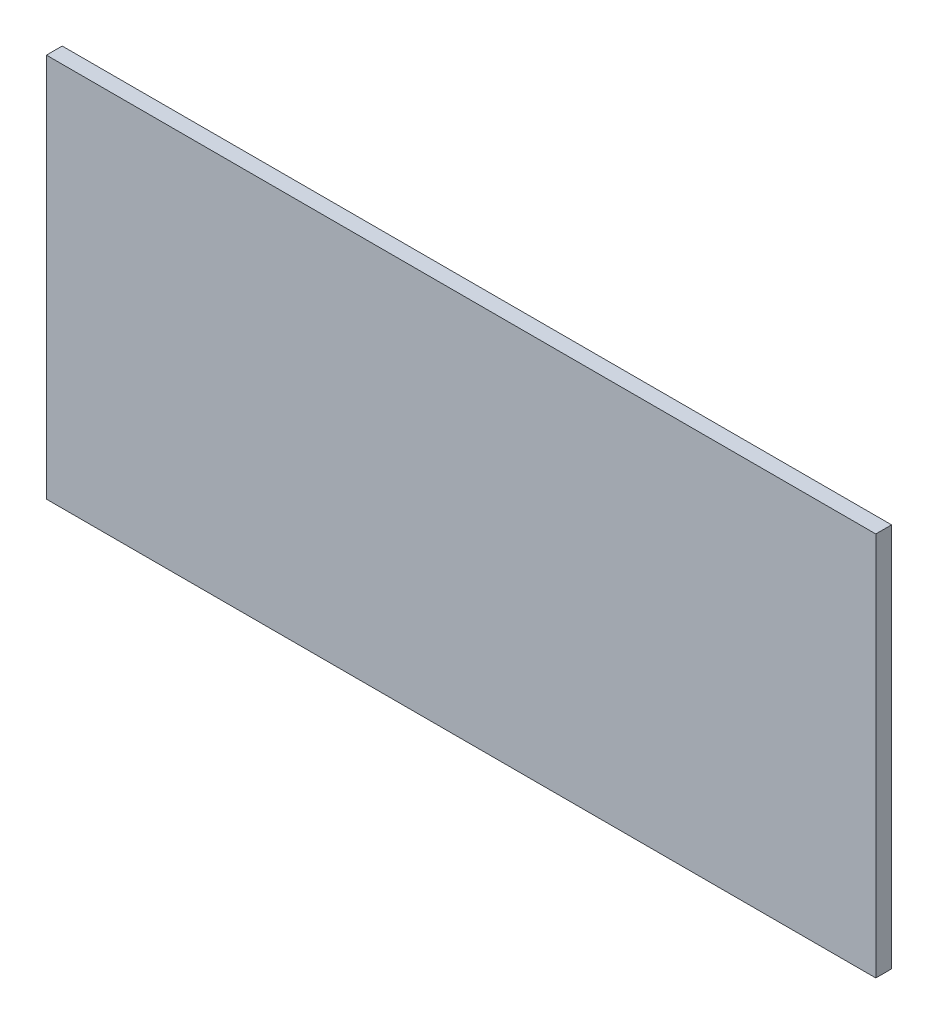
ISO-10303-21;
HEADER;
FILE_DESCRIPTION(('STEP AP214'),'2;1');
FILE_NAME('part.step','',(''),(''),'','','');
FILE_SCHEMA(('AUTOMOTIVE_DESIGN { 1 0 10303 214 1 1 1 1 }'));
ENDSEC;
DATA;
#1=APPLICATION_CONTEXT('core data for automotive mechanical design processes');
#2=APPLICATION_PROTOCOL_DEFINITION('international standard','automotive_design',2000,#1);
#3=PRODUCT_CONTEXT('',#1,'mechanical');
#4=PRODUCT('Part','Part','',(#3));
#5=PRODUCT_RELATED_PRODUCT_CATEGORY('part','',(#4));
#6=PRODUCT_DEFINITION_FORMATION('','',#4);
#7=PRODUCT_DEFINITION_CONTEXT('part definition',#1,'design');
#8=PRODUCT_DEFINITION('design','',#6,#7);
#9=PRODUCT_DEFINITION_SHAPE('','',#8);
#10=(LENGTH_UNIT() NAMED_UNIT(*) SI_UNIT(.MILLI.,.METRE.));
#11=(NAMED_UNIT(*) PLANE_ANGLE_UNIT() SI_UNIT($,.RADIAN.));
#12=(NAMED_UNIT(*) SI_UNIT($,.STERADIAN.) SOLID_ANGLE_UNIT());
#13=UNCERTAINTY_MEASURE_WITH_UNIT(LENGTH_MEASURE(1.E-05),#10,'distance_accuracy_value','');
#14=(GEOMETRIC_REPRESENTATION_CONTEXT(3) GLOBAL_UNCERTAINTY_ASSIGNED_CONTEXT((#13)) GLOBAL_UNIT_ASSIGNED_CONTEXT((#10,
#11,#12)) REPRESENTATION_CONTEXT('',''));
#15=CARTESIAN_POINT('',(0.,0.,0.));
#16=DIRECTION('',(0.,0.,1.));
#17=DIRECTION('',(1.,0.,0.));
#18=AXIS2_PLACEMENT_3D('',#15,#16,#17);
#19=CARTESIAN_POINT('',(578.,-268.,22.));
#20=DIRECTION('',(-1.,0.,0.));
#21=DIRECTION('',(0.,0.,1.));
#22=AXIS2_PLACEMENT_3D('',#19,#20,#21);
#23=PLANE('',#22);
#24=DIRECTION('',(0.,1.,0.));
#25=VECTOR('',#24,1.);
#26=CARTESIAN_POINT('',(578.,-268.,0.));
#27=LINE('',#26,#25);
#28=CARTESIAN_POINT('',(578.,-268.,0.));
#29=VERTEX_POINT('',#28);
#30=CARTESIAN_POINT('',(578.,268.,0.));
#31=VERTEX_POINT('',#30);
#32=EDGE_CURVE('E96',#29,#31,#27,.T.);
#33=ORIENTED_EDGE('',*,*,#32,.T.);
#34=DIRECTION('',(0.,0.,-1.));
#35=VECTOR('',#34,1.);
#36=CARTESIAN_POINT('',(578.,268.,22.));
#37=LINE('',#36,#35);
#38=CARTESIAN_POINT('',(578.,268.,22.));
#39=VERTEX_POINT('',#38);
#40=EDGE_CURVE('E11',#39,#31,#37,.T.);
#41=ORIENTED_EDGE('',*,*,#40,.F.);
#42=DIRECTION('',(0.,1.,0.));
#43=VECTOR('',#42,1.);
#44=CARTESIAN_POINT('',(578.,-268.,22.));
#45=LINE('',#44,#43);
#46=CARTESIAN_POINT('',(578.,-268.,22.));
#47=VERTEX_POINT('',#46);
#48=EDGE_CURVE('E84',#47,#39,#45,.T.);
#49=ORIENTED_EDGE('',*,*,#48,.F.);
#50=DIRECTION('',(0.,0.,-1.));
#51=VECTOR('',#50,1.);
#52=CARTESIAN_POINT('',(578.,-268.,22.));
#53=LINE('',#52,#51);
#54=EDGE_CURVE('E92',#47,#29,#53,.T.);
#55=ORIENTED_EDGE('',*,*,#54,.T.);
#56=EDGE_LOOP('',(#33,#41,#49,#55));
#57=FACE_BOUND('',#56,.T.);
#58=ADVANCED_FACE('F33',(#57),#23,.F.);
#59=CARTESIAN_POINT('',(-578.,268.,22.));
#60=DIRECTION('',(0.,-1.,0.));
#61=DIRECTION('',(0.,0.,-1.));
#62=AXIS2_PLACEMENT_3D('',#59,#60,#61);
#63=PLANE('',#62);
#64=DIRECTION('',(-1.,0.,0.));
#65=VECTOR('',#64,1.);
#66=CARTESIAN_POINT('',(-578.,268.,0.));
#67=LINE('',#66,#65);
#68=CARTESIAN_POINT('',(-578.,268.,0.));
#69=VERTEX_POINT('',#68);
#70=EDGE_CURVE('E88',#31,#69,#67,.T.);
#71=ORIENTED_EDGE('',*,*,#70,.T.);
#72=DIRECTION('',(0.,0.,-1.));
#73=VECTOR('',#72,1.);
#74=CARTESIAN_POINT('',(-578.,268.,22.));
#75=LINE('',#74,#73);
#76=CARTESIAN_POINT('',(-578.,268.,22.));
#77=VERTEX_POINT('',#76);
#78=EDGE_CURVE('E41',#77,#69,#75,.T.);
#79=ORIENTED_EDGE('',*,*,#78,.F.);
#80=DIRECTION('',(-1.,0.,0.));
#81=VECTOR('',#80,1.);
#82=CARTESIAN_POINT('',(-578.,268.,22.));
#83=LINE('',#82,#81);
#84=EDGE_CURVE('E79',#39,#77,#83,.T.);
#85=ORIENTED_EDGE('',*,*,#84,.F.);
#86=ORIENTED_EDGE('',*,*,#40,.T.);
#87=EDGE_LOOP('',(#71,#79,#85,#86));
#88=FACE_BOUND('',#87,.T.);
#89=ADVANCED_FACE('F87',(#88),#63,.F.);
#90=CARTESIAN_POINT('',(-578.,-268.,22.));
#91=DIRECTION('',(1.,0.,0.));
#92=DIRECTION('',(0.,0.,-1.));
#93=AXIS2_PLACEMENT_3D('',#90,#91,#92);
#94=PLANE('',#93);
#95=DIRECTION('',(0.,-1.,0.));
#96=VECTOR('',#95,1.);
#97=CARTESIAN_POINT('',(-578.,-268.,0.));
#98=LINE('',#97,#96);
#99=CARTESIAN_POINT('',(-578.,-268.,0.));
#100=VERTEX_POINT('',#99);
#101=EDGE_CURVE('E66',#69,#100,#98,.T.);
#102=ORIENTED_EDGE('',*,*,#101,.T.);
#103=DIRECTION('',(0.,0.,-1.));
#104=VECTOR('',#103,1.);
#105=CARTESIAN_POINT('',(-578.,-268.,22.));
#106=LINE('',#105,#104);
#107=CARTESIAN_POINT('',(-578.,-268.,22.));
#108=VERTEX_POINT('',#107);
#109=EDGE_CURVE('E89',#108,#100,#106,.T.);
#110=ORIENTED_EDGE('',*,*,#109,.F.);
#111=DIRECTION('',(0.,-1.,0.));
#112=VECTOR('',#111,1.);
#113=CARTESIAN_POINT('',(-578.,-268.,22.));
#114=LINE('',#113,#112);
#115=EDGE_CURVE('E82',#77,#108,#114,.T.);
#116=ORIENTED_EDGE('',*,*,#115,.F.);
#117=ORIENTED_EDGE('',*,*,#78,.T.);
#118=EDGE_LOOP('',(#102,#110,#116,#117));
#119=FACE_BOUND('',#118,.T.);
#120=ADVANCED_FACE('F90',(#119),#94,.F.);
#121=CARTESIAN_POINT('',(-578.,-268.,22.));
#122=DIRECTION('',(0.,1.,0.));
#123=DIRECTION('',(0.,0.,1.));
#124=AXIS2_PLACEMENT_3D('',#121,#122,#123);
#125=PLANE('',#124);
#126=DIRECTION('',(1.,0.,0.));
#127=VECTOR('',#126,1.);
#128=CARTESIAN_POINT('',(-578.,-268.,0.));
#129=LINE('',#128,#127);
#130=EDGE_CURVE('E72',#100,#29,#129,.T.);
#131=ORIENTED_EDGE('',*,*,#130,.T.);
#132=ORIENTED_EDGE('',*,*,#54,.F.);
#133=DIRECTION('',(1.,0.,0.));
#134=VECTOR('',#133,1.);
#135=CARTESIAN_POINT('',(-578.,-268.,22.));
#136=LINE('',#135,#134);
#137=EDGE_CURVE('E49',#108,#47,#136,.T.);
#138=ORIENTED_EDGE('',*,*,#137,.F.);
#139=ORIENTED_EDGE('',*,*,#109,.T.);
#140=EDGE_LOOP('',(#131,#132,#138,#139));
#141=FACE_BOUND('',#140,.T.);
#142=ADVANCED_FACE('F103',(#141),#125,.F.);
#143=CARTESIAN_POINT('',(0.,0.,22.));
#144=DIRECTION('',(0.,0.,-1.));
#145=DIRECTION('',(-1.,0.,0.));
#146=AXIS2_PLACEMENT_3D('',#143,#144,#145);
#147=PLANE('',#146);
#148=ORIENTED_EDGE('',*,*,#48,.T.);
#149=ORIENTED_EDGE('',*,*,#84,.T.);
#150=ORIENTED_EDGE('',*,*,#115,.T.);
#151=ORIENTED_EDGE('',*,*,#137,.T.);
#152=EDGE_LOOP('',(#148,#149,#150,#151));
#153=FACE_BOUND('',#152,.T.);
#154=ADVANCED_FACE('F80',(#153),#147,.F.);
#155=CARTESIAN_POINT('',(0.,0.,0.));
#156=DIRECTION('',(0.,0.,-1.));
#157=DIRECTION('',(-1.,0.,0.));
#158=AXIS2_PLACEMENT_3D('',#155,#156,#157);
#159=PLANE('',#158);
#160=ORIENTED_EDGE('',*,*,#32,.F.);
#161=ORIENTED_EDGE('',*,*,#130,.F.);
#162=ORIENTED_EDGE('',*,*,#101,.F.);
#163=ORIENTED_EDGE('',*,*,#70,.F.);
#164=EDGE_LOOP('',(#160,#161,#162,#163));
#165=FACE_BOUND('',#164,.T.);
#166=ADVANCED_FACE('F106',(#165),#159,.T.);
#167=CLOSED_SHELL('',(#58,#89,#120,#142,#154,#166));
#168=MANIFOLD_SOLID_BREP('B2',#167);
#169=ADVANCED_BREP_SHAPE_REPRESENTATION('',(#18,#168),#14);
#170=SHAPE_DEFINITION_REPRESENTATION(#9,#169);
ENDSEC;
END-ISO-10303-21;
